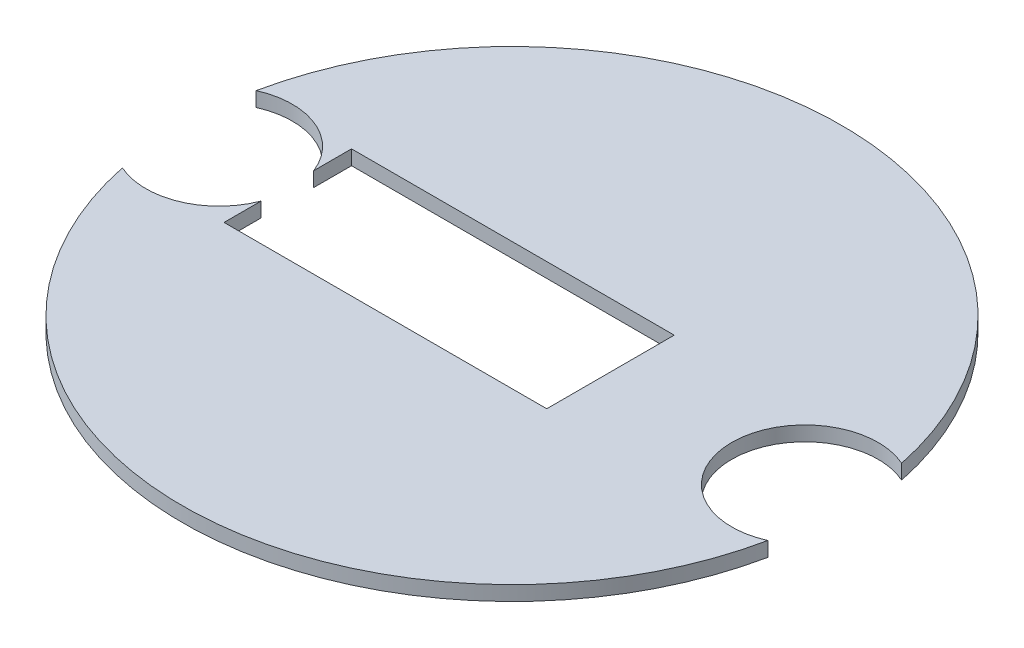
ISO-10303-21;
HEADER;
FILE_DESCRIPTION(('STEP AP214'),'2;1');
FILE_NAME('part.step','',(''),(''),'','','');
FILE_SCHEMA(('AUTOMOTIVE_DESIGN { 1 0 10303 214 1 1 1 1 }'));
ENDSEC;
DATA;
#1=APPLICATION_CONTEXT('core data for automotive mechanical design processes');
#2=APPLICATION_PROTOCOL_DEFINITION('international standard','automotive_design',2000,#1);
#3=PRODUCT_CONTEXT('',#1,'mechanical');
#4=PRODUCT('Part','Part','',(#3));
#5=PRODUCT_RELATED_PRODUCT_CATEGORY('part','',(#4));
#6=PRODUCT_DEFINITION_FORMATION('','',#4);
#7=PRODUCT_DEFINITION_CONTEXT('part definition',#1,'design');
#8=PRODUCT_DEFINITION('design','',#6,#7);
#9=PRODUCT_DEFINITION_SHAPE('','',#8);
#10=(LENGTH_UNIT() NAMED_UNIT(*) SI_UNIT(.MILLI.,.METRE.));
#11=(NAMED_UNIT(*) PLANE_ANGLE_UNIT() SI_UNIT($,.RADIAN.));
#12=(NAMED_UNIT(*) SI_UNIT($,.STERADIAN.) SOLID_ANGLE_UNIT());
#13=UNCERTAINTY_MEASURE_WITH_UNIT(LENGTH_MEASURE(1.E-05),#10,'distance_accuracy_value','');
#14=(GEOMETRIC_REPRESENTATION_CONTEXT(3) GLOBAL_UNCERTAINTY_ASSIGNED_CONTEXT((#13)) GLOBAL_UNIT_ASSIGNED_CONTEXT((#10,
#11,#12)) REPRESENTATION_CONTEXT('',''));
#15=CARTESIAN_POINT('',(0.,0.,0.));
#16=DIRECTION('',(0.,0.,1.));
#17=DIRECTION('',(1.,0.,0.));
#18=AXIS2_PLACEMENT_3D('',#15,#16,#17);
#19=CARTESIAN_POINT('',(0.,2.54,0.));
#20=DIRECTION('',(0.,-1.,0.));
#21=DIRECTION('',(0.,0.,-1.));
#22=AXIS2_PLACEMENT_3D('',#19,#20,#21);
#23=CYLINDRICAL_SURFACE('',#22,57.15);
#24=CARTESIAN_POINT('',(0.,0.,0.));
#25=DIRECTION('',(0.,1.,0.));
#26=DIRECTION('',(0.,0.,1.));
#27=AXIS2_PLACEMENT_3D('',#24,#25,#26);
#28=CIRCLE('',#27,57.15);
#29=CARTESIAN_POINT('',(-55.9593750000001,0.,11.6047770167878));
#30=VERTEX_POINT('',#29);
#31=CARTESIAN_POINT('',(55.959375,0.,11.6047770167882));
#32=VERTEX_POINT('',#31);
#33=EDGE_CURVE('E130',#30,#32,#28,.T.);
#34=ORIENTED_EDGE('',*,*,#33,.T.);
#35=DIRECTION('',(0.,-1.,0.));
#36=VECTOR('',#35,1.);
#37=CARTESIAN_POINT('',(55.959375,1.27,11.6047770167882));
#38=LINE('',#37,#36);
#39=CARTESIAN_POINT('',(55.959375,2.54,11.6047770167882));
#40=VERTEX_POINT('',#39);
#41=EDGE_CURVE('E11',#32,#40,#38,.F.);
#42=ORIENTED_EDGE('',*,*,#41,.T.);
#43=CARTESIAN_POINT('',(0.,2.54,0.));
#44=DIRECTION('',(0.,1.,0.));
#45=DIRECTION('',(0.,0.,1.));
#46=AXIS2_PLACEMENT_3D('',#43,#44,#45);
#47=CIRCLE('',#46,57.15);
#48=CARTESIAN_POINT('',(-55.9593750000001,2.54,11.6047770167878));
#49=VERTEX_POINT('',#48);
#50=EDGE_CURVE('E137',#49,#40,#47,.T.);
#51=ORIENTED_EDGE('',*,*,#50,.F.);
#52=DIRECTION('',(0.,-1.,0.));
#53=VECTOR('',#52,1.);
#54=CARTESIAN_POINT('',(-55.9593750000001,1.27,11.6047770167878));
#55=LINE('',#54,#53);
#56=EDGE_CURVE('E134',#49,#30,#55,.T.);
#57=ORIENTED_EDGE('',*,*,#56,.T.);
#58=EDGE_LOOP('',(#34,#42,#51,#57));
#59=FACE_BOUND('',#58,.T.);
#60=ADVANCED_FACE('F43',(#59),#23,.T.);
#61=CARTESIAN_POINT('',(-38.9499892594056,0.,10.9848480504642));
#62=DIRECTION('',(1.,0.,0.));
#63=DIRECTION('',(0.,0.,-1.));
#64=AXIS2_PLACEMENT_3D('',#61,#62,#63);
#65=PLANE('',#64);
#66=DIRECTION('',(0.,-1.,0.));
#67=VECTOR('',#66,1.);
#68=CARTESIAN_POINT('',(-38.9499892594056,2.54,4.56806802136256));
#69=LINE('',#68,#67);
#70=CARTESIAN_POINT('',(-38.9499892594056,2.54,4.56806802136256));
#71=VERTEX_POINT('',#70);
#72=CARTESIAN_POINT('',(-38.9499892594056,0.,4.56806802136256));
#73=VERTEX_POINT('',#72);
#74=EDGE_CURVE('E144',#71,#73,#69,.T.);
#75=ORIENTED_EDGE('',*,*,#74,.F.);
#76=DIRECTION('',(0.,0.,-1.));
#77=VECTOR('',#76,1.);
#78=CARTESIAN_POINT('',(-38.9499892594056,2.54,10.9848480504642));
#79=LINE('',#78,#77);
#80=CARTESIAN_POINT('',(-38.9499892594056,2.54,10.9848480504642));
#81=VERTEX_POINT('',#80);
#82=EDGE_CURVE('E177',#81,#71,#79,.T.);
#83=ORIENTED_EDGE('',*,*,#82,.F.);
#84=DIRECTION('',(0.,1.,0.));
#85=VECTOR('',#84,1.);
#86=CARTESIAN_POINT('',(-38.9499892594056,0.,10.9848480504642));
#87=LINE('',#86,#85);
#88=CARTESIAN_POINT('',(-38.9499892594056,0.,10.9848480504642));
#89=VERTEX_POINT('',#88);
#90=EDGE_CURVE('E176',#89,#81,#87,.T.);
#91=ORIENTED_EDGE('',*,*,#90,.F.);
#92=DIRECTION('',(0.,0.,-1.));
#93=VECTOR('',#92,1.);
#94=CARTESIAN_POINT('',(-38.9499892594056,0.,10.9848480504642));
#95=LINE('',#94,#93);
#96=EDGE_CURVE('E164',#89,#73,#95,.T.);
#97=ORIENTED_EDGE('',*,*,#96,.T.);
#98=EDGE_LOOP('',(#75,#83,#91,#97));
#99=FACE_BOUND('',#98,.T.);
#100=ADVANCED_FACE('F227',(#99),#65,.T.);
#101=CARTESIAN_POINT('',(0.,2.54,0.));
#102=DIRECTION('',(0.,1.,0.));
#103=DIRECTION('',(0.,0.,1.));
#104=AXIS2_PLACEMENT_3D('',#101,#102,#103);
#105=PLANE('',#104);
#106=CARTESIAN_POINT('',(50.8,2.54,0.));
#107=DIRECTION('',(0.,-1.,0.));
#108=DIRECTION('',(0.,0.,-1.));
#109=AXIS2_PLACEMENT_3D('',#106,#107,#108);
#110=CIRCLE('',#109,12.7);
#111=CARTESIAN_POINT('',(55.959375,2.54,-11.6047770167882));
#112=VERTEX_POINT('',#111);
#113=EDGE_CURVE('E120',#40,#112,#110,.T.);
#114=ORIENTED_EDGE('',*,*,#113,.T.);
#115=CARTESIAN_POINT('',(-55.9593749999999,2.54,-11.6047770167886));
#116=VERTEX_POINT('',#115);
#117=EDGE_CURVE('E135',#112,#116,#47,.T.);
#118=ORIENTED_EDGE('',*,*,#117,.T.);
#119=CARTESIAN_POINT('',(-50.8,2.54,-3.59848262299067E-13));
#120=DIRECTION('',(0.,-1.,0.));
#121=DIRECTION('',(0.,0.,-1.));
#122=AXIS2_PLACEMENT_3D('',#119,#120,#121);
#123=CIRCLE('',#122,12.7);
#124=CARTESIAN_POINT('',(-38.9499892594056,2.54,-4.56806802136328));
#125=VERTEX_POINT('',#124);
#126=EDGE_CURVE('E157',#116,#125,#123,.T.);
#127=ORIENTED_EDGE('',*,*,#126,.T.);
#128=CARTESIAN_POINT('',(-38.9499892594056,2.54,-11.1220566551502));
#129=VERTEX_POINT('',#128);
#130=EDGE_CURVE('E163',#125,#129,#79,.T.);
#131=ORIENTED_EDGE('',*,*,#130,.T.);
#132=DIRECTION('',(1.,0.,0.));
#133=VECTOR('',#132,1.);
#134=CARTESIAN_POINT('',(-38.9499892594056,2.54,-11.1220566551502));
#135=LINE('',#134,#133);
#136=CARTESIAN_POINT('',(17.0088991827679,2.54,-11.1220566551502));
#137=VERTEX_POINT('',#136);
#138=EDGE_CURVE('E180',#129,#137,#135,.T.);
#139=ORIENTED_EDGE('',*,*,#138,.T.);
#140=DIRECTION('',(0.,0.,-1.));
#141=VECTOR('',#140,1.);
#142=CARTESIAN_POINT('',(17.0088991827679,2.54,10.9848480504642));
#143=LINE('',#142,#141);
#144=CARTESIAN_POINT('',(17.0088991827679,2.54,10.9848480504642));
#145=VERTEX_POINT('',#144);
#146=EDGE_CURVE('E183',#145,#137,#143,.T.);
#147=ORIENTED_EDGE('',*,*,#146,.F.);
#148=DIRECTION('',(1.,0.,0.));
#149=VECTOR('',#148,1.);
#150=CARTESIAN_POINT('',(-38.9499892594056,2.54,10.9848480504642));
#151=LINE('',#150,#149);
#152=EDGE_CURVE('E186',#81,#145,#151,.T.);
#153=ORIENTED_EDGE('',*,*,#152,.F.);
#154=ORIENTED_EDGE('',*,*,#82,.T.);
#155=EDGE_CURVE('E158',#71,#49,#123,.T.);
#156=ORIENTED_EDGE('',*,*,#155,.T.);
#157=ORIENTED_EDGE('',*,*,#50,.T.);
#158=EDGE_LOOP('',(#114,#118,#127,#131,#139,#147,#153,#154,#156,#157));
#159=FACE_BOUND('',#158,.T.);
#160=ADVANCED_FACE('F149',(#159),#105,.T.);
#161=CARTESIAN_POINT('',(0.,0.,0.));
#162=DIRECTION('',(0.,1.,0.));
#163=DIRECTION('',(0.,0.,1.));
#164=AXIS2_PLACEMENT_3D('',#161,#162,#163);
#165=PLANE('',#164);
#166=CARTESIAN_POINT('',(55.959375,0.,-11.6047770167882));
#167=VERTEX_POINT('',#166);
#168=CARTESIAN_POINT('',(-55.9593749999999,0.,-11.6047770167886));
#169=VERTEX_POINT('',#168);
#170=EDGE_CURVE('E131',#167,#169,#28,.T.);
#171=ORIENTED_EDGE('',*,*,#170,.F.);
#172=CARTESIAN_POINT('',(50.8,0.,0.));
#173=DIRECTION('',(0.,-1.,0.));
#174=DIRECTION('',(0.,0.,-1.));
#175=AXIS2_PLACEMENT_3D('',#172,#173,#174);
#176=CIRCLE('',#175,12.7);
#177=EDGE_CURVE('E58',#32,#167,#176,.T.);
#178=ORIENTED_EDGE('',*,*,#177,.F.);
#179=ORIENTED_EDGE('',*,*,#33,.F.);
#180=CARTESIAN_POINT('',(-50.8,0.,-3.59848262299067E-13));
#181=DIRECTION('',(0.,-1.,0.));
#182=DIRECTION('',(0.,0.,-1.));
#183=AXIS2_PLACEMENT_3D('',#180,#181,#182);
#184=CIRCLE('',#183,12.7);
#185=EDGE_CURVE('E154',#73,#30,#184,.T.);
#186=ORIENTED_EDGE('',*,*,#185,.F.);
#187=ORIENTED_EDGE('',*,*,#96,.F.);
#188=DIRECTION('',(1.,0.,0.));
#189=VECTOR('',#188,1.);
#190=CARTESIAN_POINT('',(-38.9499892594056,0.,10.9848480504642));
#191=LINE('',#190,#189);
#192=CARTESIAN_POINT('',(17.0088991827679,0.,10.9848480504642));
#193=VERTEX_POINT('',#192);
#194=EDGE_CURVE('E173',#89,#193,#191,.T.);
#195=ORIENTED_EDGE('',*,*,#194,.T.);
#196=DIRECTION('',(0.,0.,-1.));
#197=VECTOR('',#196,1.);
#198=CARTESIAN_POINT('',(17.0088991827679,0.,10.9848480504642));
#199=LINE('',#198,#197);
#200=CARTESIAN_POINT('',(17.0088991827679,0.,-11.1220566551502));
#201=VERTEX_POINT('',#200);
#202=EDGE_CURVE('E170',#193,#201,#199,.T.);
#203=ORIENTED_EDGE('',*,*,#202,.T.);
#204=DIRECTION('',(1.,0.,0.));
#205=VECTOR('',#204,1.);
#206=CARTESIAN_POINT('',(-38.9499892594056,0.,-11.1220566551502));
#207=LINE('',#206,#205);
#208=CARTESIAN_POINT('',(-38.9499892594056,0.,-11.1220566551502));
#209=VERTEX_POINT('',#208);
#210=EDGE_CURVE('E167',#209,#201,#207,.T.);
#211=ORIENTED_EDGE('',*,*,#210,.F.);
#212=CARTESIAN_POINT('',(-38.9499892594056,0.,-4.56806802136328));
#213=VERTEX_POINT('',#212);
#214=EDGE_CURVE('E168',#213,#209,#95,.T.);
#215=ORIENTED_EDGE('',*,*,#214,.F.);
#216=EDGE_CURVE('E66',#169,#213,#184,.T.);
#217=ORIENTED_EDGE('',*,*,#216,.F.);
#218=EDGE_LOOP('',(#171,#178,#179,#186,#187,#195,#203,#211,#215,#217));
#219=FACE_BOUND('',#218,.T.);
#220=ADVANCED_FACE('F128',(#219),#165,.F.);
#221=ORIENTED_EDGE('',*,*,#117,.F.);
#222=DIRECTION('',(0.,-1.,0.));
#223=VECTOR('',#222,1.);
#224=CARTESIAN_POINT('',(55.959375,1.27,-11.6047770167882));
#225=LINE('',#224,#223);
#226=EDGE_CURVE('E51',#112,#167,#225,.T.);
#227=ORIENTED_EDGE('',*,*,#226,.T.);
#228=ORIENTED_EDGE('',*,*,#170,.T.);
#229=DIRECTION('',(0.,-1.,0.));
#230=VECTOR('',#229,1.);
#231=CARTESIAN_POINT('',(-55.9593749999999,1.27,-11.6047770167886));
#232=LINE('',#231,#230);
#233=EDGE_CURVE('E161',#169,#116,#232,.F.);
#234=ORIENTED_EDGE('',*,*,#233,.T.);
#235=EDGE_LOOP('',(#221,#227,#228,#234));
#236=FACE_BOUND('',#235,.T.);
#237=ADVANCED_FACE('F45',(#236),#23,.T.);
#238=DIRECTION('',(0.,-1.,0.));
#239=VECTOR('',#238,1.);
#240=CARTESIAN_POINT('',(-38.9499892594056,2.54,-4.56806802136328));
#241=LINE('',#240,#239);
#242=EDGE_CURVE('E142',#213,#125,#241,.F.);
#243=ORIENTED_EDGE('',*,*,#242,.F.);
#244=ORIENTED_EDGE('',*,*,#214,.T.);
#245=DIRECTION('',(0.,1.,0.));
#246=VECTOR('',#245,1.);
#247=CARTESIAN_POINT('',(-38.9499892594056,0.,-11.1220566551502));
#248=LINE('',#247,#246);
#249=EDGE_CURVE('E139',#209,#129,#248,.T.);
#250=ORIENTED_EDGE('',*,*,#249,.T.);
#251=ORIENTED_EDGE('',*,*,#130,.F.);
#252=EDGE_LOOP('',(#243,#244,#250,#251));
#253=FACE_BOUND('',#252,.T.);
#254=ADVANCED_FACE('F198',(#253),#65,.T.);
#255=CARTESIAN_POINT('',(-38.9499892594056,0.,-11.1220566551502));
#256=DIRECTION('',(0.,0.,1.));
#257=DIRECTION('',(1.,0.,0.));
#258=AXIS2_PLACEMENT_3D('',#255,#256,#257);
#259=PLANE('',#258);
#260=ORIENTED_EDGE('',*,*,#138,.F.);
#261=ORIENTED_EDGE('',*,*,#249,.F.);
#262=ORIENTED_EDGE('',*,*,#210,.T.);
#263=DIRECTION('',(0.,1.,0.));
#264=VECTOR('',#263,1.);
#265=CARTESIAN_POINT('',(17.0088991827679,0.,-11.1220566551502));
#266=LINE('',#265,#264);
#267=EDGE_CURVE('E193',#201,#137,#266,.T.);
#268=ORIENTED_EDGE('',*,*,#267,.T.);
#269=EDGE_LOOP('',(#260,#261,#262,#268));
#270=FACE_BOUND('',#269,.T.);
#271=ADVANCED_FACE('F203',(#270),#259,.T.);
#272=CARTESIAN_POINT('',(17.0088991827679,0.,10.9848480504642));
#273=DIRECTION('',(1.,0.,0.));
#274=DIRECTION('',(0.,0.,-1.));
#275=AXIS2_PLACEMENT_3D('',#272,#273,#274);
#276=PLANE('',#275);
#277=ORIENTED_EDGE('',*,*,#146,.T.);
#278=ORIENTED_EDGE('',*,*,#267,.F.);
#279=ORIENTED_EDGE('',*,*,#202,.F.);
#280=DIRECTION('',(0.,1.,0.));
#281=VECTOR('',#280,1.);
#282=CARTESIAN_POINT('',(17.0088991827679,0.,10.9848480504642));
#283=LINE('',#282,#281);
#284=EDGE_CURVE('E191',#193,#145,#283,.T.);
#285=ORIENTED_EDGE('',*,*,#284,.T.);
#286=EDGE_LOOP('',(#277,#278,#279,#285));
#287=FACE_BOUND('',#286,.T.);
#288=ADVANCED_FACE('F209',(#287),#276,.F.);
#289=CARTESIAN_POINT('',(-38.9499892594056,0.,10.9848480504642));
#290=DIRECTION('',(0.,0.,1.));
#291=DIRECTION('',(1.,0.,0.));
#292=AXIS2_PLACEMENT_3D('',#289,#290,#291);
#293=PLANE('',#292);
#294=ORIENTED_EDGE('',*,*,#152,.T.);
#295=ORIENTED_EDGE('',*,*,#284,.F.);
#296=ORIENTED_EDGE('',*,*,#194,.F.);
#297=ORIENTED_EDGE('',*,*,#90,.T.);
#298=EDGE_LOOP('',(#294,#295,#296,#297));
#299=FACE_BOUND('',#298,.T.);
#300=ADVANCED_FACE('F211',(#299),#293,.F.);
#301=CARTESIAN_POINT('',(-50.8,2.54,-3.59848262299067E-13));
#302=DIRECTION('',(0.,-1.,0.));
#303=DIRECTION('',(0.,0.,-1.));
#304=AXIS2_PLACEMENT_3D('',#301,#302,#303);
#305=CYLINDRICAL_SURFACE('',#304,12.7);
#306=ORIENTED_EDGE('',*,*,#216,.T.);
#307=ORIENTED_EDGE('',*,*,#242,.T.);
#308=ORIENTED_EDGE('',*,*,#126,.F.);
#309=ORIENTED_EDGE('',*,*,#233,.F.);
#310=EDGE_LOOP('',(#306,#307,#308,#309));
#311=FACE_BOUND('',#310,.T.);
#312=ADVANCED_FACE('F214',(#311),#305,.F.);
#313=ORIENTED_EDGE('',*,*,#155,.F.);
#314=ORIENTED_EDGE('',*,*,#74,.T.);
#315=ORIENTED_EDGE('',*,*,#185,.T.);
#316=ORIENTED_EDGE('',*,*,#56,.F.);
#317=EDGE_LOOP('',(#313,#314,#315,#316));
#318=FACE_BOUND('',#317,.T.);
#319=ADVANCED_FACE('F216',(#318),#305,.F.);
#320=CARTESIAN_POINT('',(50.8,2.54,0.));
#321=DIRECTION('',(0.,-1.,0.));
#322=DIRECTION('',(0.,0.,-1.));
#323=AXIS2_PLACEMENT_3D('',#320,#321,#322);
#324=CYLINDRICAL_SURFACE('',#323,12.7);
#325=ORIENTED_EDGE('',*,*,#177,.T.);
#326=ORIENTED_EDGE('',*,*,#226,.F.);
#327=ORIENTED_EDGE('',*,*,#113,.F.);
#328=ORIENTED_EDGE('',*,*,#41,.F.);
#329=EDGE_LOOP('',(#325,#326,#327,#328));
#330=FACE_BOUND('',#329,.T.);
#331=ADVANCED_FACE('F118',(#330),#324,.F.);
#332=CLOSED_SHELL('',(#60,#100,#160,#220,#237,#254,#271,#288,#300,#312,#319,#331));
#333=MANIFOLD_SOLID_BREP('B2',#332);
#334=ADVANCED_BREP_SHAPE_REPRESENTATION('',(#18,#333),#14);
#335=SHAPE_DEFINITION_REPRESENTATION(#9,#334);
ENDSEC;
END-ISO-10303-21;
